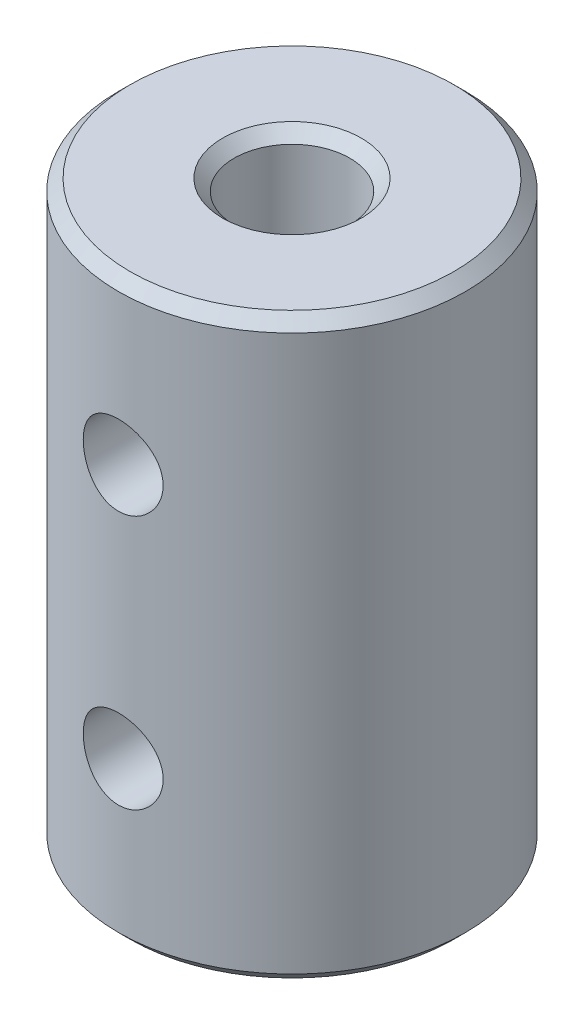
ISO-10303-21;
HEADER;
FILE_DESCRIPTION(('STEP AP214'),'2;1');
FILE_NAME('part.step','',(''),(''),'','','');
FILE_SCHEMA(('AUTOMOTIVE_DESIGN { 1 0 10303 214 1 1 1 1 }'));
ENDSEC;
DATA;
#1=APPLICATION_CONTEXT('core data for automotive mechanical design processes');
#2=APPLICATION_PROTOCOL_DEFINITION('international standard','automotive_design',2000,#1);
#3=PRODUCT_CONTEXT('',#1,'mechanical');
#4=PRODUCT('Part','Part','',(#3));
#5=PRODUCT_RELATED_PRODUCT_CATEGORY('part','',(#4));
#6=PRODUCT_DEFINITION_FORMATION('','',#4);
#7=PRODUCT_DEFINITION_CONTEXT('part definition',#1,'design');
#8=PRODUCT_DEFINITION('design','',#6,#7);
#9=PRODUCT_DEFINITION_SHAPE('','',#8);
#10=(LENGTH_UNIT() NAMED_UNIT(*) SI_UNIT(.MILLI.,.METRE.));
#11=(NAMED_UNIT(*) PLANE_ANGLE_UNIT() SI_UNIT($,.RADIAN.));
#12=(NAMED_UNIT(*) SI_UNIT($,.STERADIAN.) SOLID_ANGLE_UNIT());
#13=UNCERTAINTY_MEASURE_WITH_UNIT(LENGTH_MEASURE(1.E-05),#10,'distance_accuracy_value','');
#14=(GEOMETRIC_REPRESENTATION_CONTEXT(3) GLOBAL_UNCERTAINTY_ASSIGNED_CONTEXT((#13)) GLOBAL_UNIT_ASSIGNED_CONTEXT((#10,
#11,#12)) REPRESENTATION_CONTEXT('',''));
#15=CARTESIAN_POINT('',(0.,0.,0.));
#16=DIRECTION('',(0.,0.,1.));
#17=DIRECTION('',(1.,0.,0.));
#18=AXIS2_PLACEMENT_3D('',#15,#16,#17);
#19=CARTESIAN_POINT('',(0.,25.,0.));
#20=DIRECTION('',(0.,1.,0.));
#21=DIRECTION('',(0.,0.,1.));
#22=AXIS2_PLACEMENT_3D('',#19,#20,#21);
#23=PLANE('',#22);
#24=CARTESIAN_POINT('',(0.,25.,0.));
#25=DIRECTION('',(0.,1.,0.));
#26=DIRECTION('',(0.,0.,1.));
#27=AXIS2_PLACEMENT_3D('',#24,#25,#26);
#28=CIRCLE('',#27,3.);
#29=CARTESIAN_POINT('',(0.,25.,3.));
#30=VERTEX_POINT('',#29);
#31=EDGE_CURVE('E12',#30,#30,#28,.F.);
#32=ORIENTED_EDGE('',*,*,#31,.T.);
#33=EDGE_LOOP('',(#32));
#34=FACE_BOUND('',#33,.T.);
#35=CARTESIAN_POINT('',(0.,25.,0.));
#36=DIRECTION('',(0.,1.,0.));
#37=DIRECTION('',(0.,0.,1.));
#38=AXIS2_PLACEMENT_3D('',#35,#36,#37);
#39=CIRCLE('',#38,6.99999999999999);
#40=CARTESIAN_POINT('',(0.,25.,6.99999999999999));
#41=VERTEX_POINT('',#40);
#42=EDGE_CURVE('E71',#41,#41,#39,.T.);
#43=ORIENTED_EDGE('',*,*,#42,.T.);
#44=EDGE_LOOP('',(#43));
#45=FACE_BOUND('',#44,.T.);
#46=ADVANCED_FACE('F56',(#34,#45),#23,.T.);
#47=CARTESIAN_POINT('',(0.,0.,0.));
#48=DIRECTION('',(0.,1.,0.));
#49=DIRECTION('',(0.,0.,1.));
#50=AXIS2_PLACEMENT_3D('',#47,#48,#49);
#51=PLANE('',#50);
#52=CARTESIAN_POINT('',(0.,0.,0.));
#53=DIRECTION('',(0.,1.,0.));
#54=DIRECTION('',(0.,0.,1.));
#55=AXIS2_PLACEMENT_3D('',#52,#53,#54);
#56=CIRCLE('',#55,3.00000000000001);
#57=CARTESIAN_POINT('',(0.,0.,3.00000000000001));
#58=VERTEX_POINT('',#57);
#59=EDGE_CURVE('E159',#58,#58,#56,.T.);
#60=ORIENTED_EDGE('',*,*,#59,.T.);
#61=EDGE_LOOP('',(#60));
#62=FACE_BOUND('',#61,.T.);
#63=CARTESIAN_POINT('',(0.,0.,0.));
#64=DIRECTION('',(0.,1.,0.));
#65=DIRECTION('',(0.,0.,1.));
#66=AXIS2_PLACEMENT_3D('',#63,#64,#65);
#67=CIRCLE('',#66,6.99999999999999);
#68=CARTESIAN_POINT('',(0.,0.,6.99999999999999));
#69=VERTEX_POINT('',#68);
#70=EDGE_CURVE('E109',#69,#69,#67,.F.);
#71=ORIENTED_EDGE('',*,*,#70,.T.);
#72=EDGE_LOOP('',(#71));
#73=FACE_BOUND('',#72,.T.);
#74=ADVANCED_FACE('F119',(#62,#73),#51,.F.);
#75=CARTESIAN_POINT('',(0.,25.,0.));
#76=DIRECTION('',(0.,-1.,0.));
#77=DIRECTION('',(0.,0.,-1.));
#78=AXIS2_PLACEMENT_3D('',#75,#76,#77);
#79=CYLINDRICAL_SURFACE('',#78,7.5);
#80=CARTESIAN_POINT('',(1.7272,18.,7.29840942671758));
#81=CARTESIAN_POINT('',(1.72719689671245,17.9043729953796,7.29841134647614));
#82=CARTESIAN_POINT('',(1.71923133997462,17.8087097940839,7.30030933888067));
#83=CARTESIAN_POINT('',(1.68762004251188,17.6201133229452,7.3076803806128));
#84=CARTESIAN_POINT('',(1.66396375706963,17.5271819328648,7.31315583408208));
#85=CARTESIAN_POINT('',(1.60176318725499,17.34680434657,7.32702953165112));
#86=CARTESIAN_POINT('',(1.56323625594468,17.2593518945419,7.3354243678974));
#87=CARTESIAN_POINT('',(1.47243892079818,17.0921470950464,7.35418679859031));
#88=CARTESIAN_POINT('',(1.4201684872622,17.0123947642195,7.36455439730007));
#89=CARTESIAN_POINT('',(1.30232498331065,16.8613617895672,7.38631100039784));
#90=CARTESIAN_POINT('',(1.23654290199238,16.7902462493096,7.39771425453314));
#91=CARTESIAN_POINT('',(1.09399428257531,16.6599545837932,7.42013297213041));
#92=CARTESIAN_POINT('',(1.01722683268334,16.6007794505801,7.43114840330814));
#93=CARTESIAN_POINT('',(0.853770992240536,16.4953872673884,7.45170642392727));
#94=CARTESIAN_POINT('',(0.766976861474525,16.4493302345622,7.46123023616209));
#95=CARTESIAN_POINT('',(0.586624003699917,16.3725187214193,7.47757040856373));
#96=CARTESIAN_POINT('',(0.493066121563366,16.3417623336417,7.48438710619264));
#97=CARTESIAN_POINT('',(0.303559973451553,16.2969478668536,7.49444428085234));
#98=CARTESIAN_POINT('',(0.207681101790785,16.2826100018029,7.49774460991315));
#99=CARTESIAN_POINT('',(0.0148259042398842,16.2701635778878,7.50060498707878));
#100=CARTESIAN_POINT('',(-0.0821502815098565,16.2720529694548,7.50016550753674));
#101=CARTESIAN_POINT('',(-0.27251440784544,16.2918015822219,7.4956411058507));
#102=CARTESIAN_POINT('',(-0.365935528962463,16.3093590843845,7.49162506020196));
#103=CARTESIAN_POINT('',(-0.548468486537816,16.3594632474946,7.48047784146183));
#104=CARTESIAN_POINT('',(-0.637580114635642,16.3920106323918,7.47334651791618));
#105=CARTESIAN_POINT('',(-0.8097868902376,16.4714293576398,7.45666116274176));
#106=CARTESIAN_POINT('',(-0.892828549862957,16.5184125623843,7.44708831360306));
#107=CARTESIAN_POINT('',(-1.04995753160044,16.6252853523069,7.42656565058289));
#108=CARTESIAN_POINT('',(-1.12404350896614,16.6851768719936,7.41561563041381));
#109=CARTESIAN_POINT('',(-1.26295463538009,16.8178001124539,7.39324127355116));
#110=CARTESIAN_POINT('',(-1.32752717014485,16.8907958124389,7.38181182113311));
#111=CARTESIAN_POINT('',(-1.44356499441821,17.0466990177492,7.36000110061708));
#112=CARTESIAN_POINT('',(-1.49502984601367,17.129606854092,7.34961986754593));
#113=CARTESIAN_POINT('',(-1.58352085597055,17.3034199357961,7.33106559577494));
#114=CARTESIAN_POINT('',(-1.62049467638203,17.3943527432184,7.32290059358562));
#115=CARTESIAN_POINT('',(-1.67855747920049,17.5813747168079,7.30981121582831));
#116=CARTESIAN_POINT('',(-1.69964928721102,17.6774629624994,7.30488626383561));
#117=CARTESIAN_POINT('',(-1.72494791577378,17.8697476808301,7.29895343710465));
#118=CARTESIAN_POINT('',(-1.72952457600022,17.9658929052232,7.29785978104561));
#119=CARTESIAN_POINT('',(-1.7226682946177,18.1575726537795,7.29948122412418));
#120=CARTESIAN_POINT('',(-1.71123658294896,18.2531072242933,7.30219603065359));
#121=CARTESIAN_POINT('',(-1.67301020426905,18.4395359869485,7.31104707112064));
#122=CARTESIAN_POINT('',(-1.6464233261477,18.5304751890556,7.31713699886768));
#123=CARTESIAN_POINT('',(-1.57886819958474,18.7066076434749,7.33200954909902));
#124=CARTESIAN_POINT('',(-1.5378984541641,18.7918002965815,7.34079245185803));
#125=CARTESIAN_POINT('',(-1.44194033690514,18.9556099834368,7.36024700637274));
#126=CARTESIAN_POINT('',(-1.38672651703692,19.0340913817216,7.37094809906197));
#127=CARTESIAN_POINT('',(-1.26413899079961,19.1808107425306,7.39295761926233));
#128=CARTESIAN_POINT('',(-1.19676360186713,19.2490472852745,7.40426613065811));
#129=CARTESIAN_POINT('',(-1.05008333340781,19.3747976231184,7.42650191246428));
#130=CARTESIAN_POINT('',(-0.970558845438631,19.4320579347302,7.43741630220506));
#131=CARTESIAN_POINT('',(-0.802805891305377,19.5324077626008,7.45738740626459));
#132=CARTESIAN_POINT('',(-0.714577853170889,19.5754979752758,7.46644421186961));
#133=CARTESIAN_POINT('',(-0.532499063825965,19.6459425393006,7.4816258862619));
#134=CARTESIAN_POINT('',(-0.438690780678517,19.6734022437443,7.48777033678839));
#135=CARTESIAN_POINT('',(-0.247633680654803,19.7121314061987,7.4965200614134));
#136=CARTESIAN_POINT('',(-0.150385424066098,19.7234034884493,7.49912590916519));
#137=CARTESIAN_POINT('',(0.0423939636632866,19.7293088013018,7.50048550927552));
#138=CARTESIAN_POINT('',(0.137913126955127,19.7243188643394,7.49932650489885));
#139=CARTESIAN_POINT('',(0.326712472008982,19.6986918591036,7.49347587000969));
#140=CARTESIAN_POINT('',(0.419992702777971,19.6780551336385,7.48878431689244));
#141=CARTESIAN_POINT('',(0.601337947366754,19.6219089853326,7.47640474868465));
#142=CARTESIAN_POINT('',(0.689422005565017,19.5864582949655,7.46872857489537));
#143=CARTESIAN_POINT('',(0.858439171500176,19.5017458979427,7.451195211126));
#144=CARTESIAN_POINT('',(0.939371505369594,19.4524826990761,7.44133778552235));
#145=CARTESIAN_POINT('',(1.09360833422484,19.3403431423654,7.42025687479298));
#146=CARTESIAN_POINT('',(1.16671920851563,19.2772049997061,7.40900924494751));
#147=CARTESIAN_POINT('',(1.30143658841965,19.1396289463342,7.38653761779372));
#148=CARTESIAN_POINT('',(1.36304027310936,19.0651882729556,7.37531362694536));
#149=CARTESIAN_POINT('',(1.47390243330295,18.9057601266172,7.3539686729821));
#150=CARTESIAN_POINT('',(1.52295927555307,18.8206296849271,7.34386704400738));
#151=CARTESIAN_POINT('',(1.60599136473468,18.6431145794032,7.32615912730855));
#152=CARTESIAN_POINT('',(1.63997875312475,18.5507358264288,7.31855083199982));
#153=CARTESIAN_POINT('',(1.68619216357411,18.3819563985902,7.30802171990387));
#154=CARTESIAN_POINT('',(1.70153923186245,18.3064359673301,7.30444213317457));
#155=CARTESIAN_POINT('',(1.72204409314212,18.153951453046,7.2996352844755));
#156=CARTESIAN_POINT('',(1.72720249839695,18.0769874570502,7.29840788115699));
#157=CARTESIAN_POINT('',(1.7272,18.,7.29840942671758));
#158=B_SPLINE_CURVE_WITH_KNOTS('',3,(#80,#81,#82,#83,#84,#85,#86,#87,#88,#89,#90,#91,#92,#93,
#94,#95,#96,#97,#98,#99,#100,#101,#102,#103,#104,#105,#106,#107,#108,#109,#110,#111,#112,#113,
#114,#115,#116,#117,#118,#119,#120,#121,#122,#123,#124,#125,#126,#127,#128,#129,#130,#131,#132,
#133,#134,#135,#136,#137,#138,#139,#140,#141,#142,#143,#144,#145,#146,#147,#148,#149,#150,#151,
#152,#153,#154,#155,#156,#157),.UNSPECIFIED.,.T.,.F.,(4,2,2,2,2,2,2,2,2,2,2,2,2,2,2,2,2,2,2,2,2,
2,2,2,2,2,2,2,2,2,2,2,2,2,2,2,2,2,4),(0.,0.286598668390399,0.573390136500472,0.859847944788198,
1.14630637211748,1.43758423379657,1.72888628577708,2.02360280831184,2.31828258068474,
2.60786231251336,2.89740546977814,3.18149044240456,3.46558913660573,3.75194736248027,
4.03834853339415,4.33134650901888,4.62435427209719,4.91841076222403,5.21241492374903,
5.49979282590026,5.78714864971366,6.0706562416737,6.35419335005768,6.64252750121625,
6.93090157426736,7.22529356474638,7.51967108461034,7.81204019676436,8.10436190644285,
8.38995837115482,8.67554857886439,8.96001710010956,9.24451636527699,9.53493184577661,
9.82541842684983,10.120315360374,10.4149742617639,10.6457231887518,10.8764582490094),.UNSPECIFIED.);
#159=CARTESIAN_POINT('',(1.7272,18.,7.29840942671758));
#160=VERTEX_POINT('',#159);
#161=EDGE_CURVE('E89',#160,#160,#158,.T.);
#162=ORIENTED_EDGE('',*,*,#161,.T.);
#163=EDGE_LOOP('',(#162));
#164=FACE_BOUND('',#163,.T.);
#165=CARTESIAN_POINT('',(1.7272,7.,7.29840942671758));
#166=CARTESIAN_POINT('',(1.72719689671245,6.9043729953796,7.29841134647614));
#167=CARTESIAN_POINT('',(1.71923133997462,6.80870979408393,7.30030933888067));
#168=CARTESIAN_POINT('',(1.68762004251188,6.62011332294517,7.3076803806128));
#169=CARTESIAN_POINT('',(1.66396375706963,6.52718193286483,7.31315583408208));
#170=CARTESIAN_POINT('',(1.60176318725498,6.34680434657005,7.32702953165112));
#171=CARTESIAN_POINT('',(1.56323625594468,6.25935189454189,7.3354243678974));
#172=CARTESIAN_POINT('',(1.47243892079817,6.09214709504637,7.35418679859031));
#173=CARTESIAN_POINT('',(1.4201684872622,6.01239476421952,7.36455439730007));
#174=CARTESIAN_POINT('',(1.30232498331065,5.86136178956722,7.38631100039784));
#175=CARTESIAN_POINT('',(1.23654290199238,5.79024624930955,7.39771425453314));
#176=CARTESIAN_POINT('',(1.09399428257531,5.65995458379321,7.42013297213041));
#177=CARTESIAN_POINT('',(1.01722683268334,5.60077945058013,7.43114840330814));
#178=CARTESIAN_POINT('',(0.853770992240534,5.49538726738837,7.45170642392727));
#179=CARTESIAN_POINT('',(0.766976861474523,5.44933023456223,7.46123023616209));
#180=CARTESIAN_POINT('',(0.586624003699915,5.37251872141932,7.47757040856373));
#181=CARTESIAN_POINT('',(0.493066121563364,5.34176233364173,7.48438710619264));
#182=CARTESIAN_POINT('',(0.303559973451551,5.29694786685357,7.49444428085234));
#183=CARTESIAN_POINT('',(0.207681101790783,5.28261000180287,7.49774460991315));
#184=CARTESIAN_POINT('',(0.0148259042398826,5.27016357788784,7.50060498707878));
#185=CARTESIAN_POINT('',(-0.0821502815098581,5.27205296945479,7.50016550753674));
#186=CARTESIAN_POINT('',(-0.272514407845442,5.29180158222189,7.4956411058507));
#187=CARTESIAN_POINT('',(-0.365935528962465,5.30935908438446,7.49162506020197));
#188=CARTESIAN_POINT('',(-0.548468486537818,5.35946324749458,7.48047784146183));
#189=CARTESIAN_POINT('',(-0.637580114635644,5.3920106323918,7.47334651791618));
#190=CARTESIAN_POINT('',(-0.809786890237602,5.47142935763976,7.45666116274176));
#191=CARTESIAN_POINT('',(-0.892828549862958,5.51841256238426,7.44708831360306));
#192=CARTESIAN_POINT('',(-1.04995753160044,5.62528535230695,7.42656565058289));
#193=CARTESIAN_POINT('',(-1.12404350896614,5.68517687199363,7.41561563041381));
#194=CARTESIAN_POINT('',(-1.26295463538009,5.81780011245392,7.39324127355116));
#195=CARTESIAN_POINT('',(-1.32752717014485,5.89079581243892,7.38181182113311));
#196=CARTESIAN_POINT('',(-1.44356499441822,6.04669901774921,7.36000110061707));
#197=CARTESIAN_POINT('',(-1.49502984601367,6.12960685409205,7.34961986754593));
#198=CARTESIAN_POINT('',(-1.58352085597055,6.30341993579612,7.33106559577494));
#199=CARTESIAN_POINT('',(-1.62049467638203,6.39435274321843,7.32290059358562));
#200=CARTESIAN_POINT('',(-1.6785574792005,6.58137471680788,7.30981121582831));
#201=CARTESIAN_POINT('',(-1.69964928721102,6.67746296249944,7.30488626383561));
#202=CARTESIAN_POINT('',(-1.72494791577378,6.86974768083015,7.29895343710465));
#203=CARTESIAN_POINT('',(-1.72952457600022,6.96589290522325,7.29785978104561));
#204=CARTESIAN_POINT('',(-1.7226682946177,7.1575726537795,7.29948122412418));
#205=CARTESIAN_POINT('',(-1.71123658294896,7.25310722429333,7.30219603065359));
#206=CARTESIAN_POINT('',(-1.67301020426905,7.43953598694853,7.31104707112064));
#207=CARTESIAN_POINT('',(-1.64642332614769,7.5304751890556,7.31713699886768));
#208=CARTESIAN_POINT('',(-1.57886819958474,7.70660764347488,7.33200954909902));
#209=CARTESIAN_POINT('',(-1.5378984541641,7.79180029658146,7.34079245185803));
#210=CARTESIAN_POINT('',(-1.44194033690514,7.95560998343677,7.36024700637274));
#211=CARTESIAN_POINT('',(-1.38672651703692,8.03409138172157,7.37094809906197));
#212=CARTESIAN_POINT('',(-1.26413899079961,8.18081074253059,7.39295761926233));
#213=CARTESIAN_POINT('',(-1.19676360186713,8.24904728527452,7.40426613065811));
#214=CARTESIAN_POINT('',(-1.05008333340781,8.37479762311838,7.42650191246428));
#215=CARTESIAN_POINT('',(-0.970558845438629,8.43205793473025,7.43741630220506));
#216=CARTESIAN_POINT('',(-0.802805891305374,8.53240776260079,7.45738740626459));
#217=CARTESIAN_POINT('',(-0.714577853170886,8.57549797527582,7.46644421186961));
#218=CARTESIAN_POINT('',(-0.532499063825962,8.6459425393006,7.4816258862619));
#219=CARTESIAN_POINT('',(-0.438690780678515,8.67340224374432,7.48777033678839));
#220=CARTESIAN_POINT('',(-0.247633680654801,8.71213140619867,7.4965200614134));
#221=CARTESIAN_POINT('',(-0.150385424066096,8.7234034884493,7.49912590916519));
#222=CARTESIAN_POINT('',(0.042393963663289,8.72930880130184,7.50048550927552));
#223=CARTESIAN_POINT('',(0.13791312695513,8.72431886433936,7.49932650489885));
#224=CARTESIAN_POINT('',(0.326712472008984,8.69869185910355,7.49347587000969));
#225=CARTESIAN_POINT('',(0.419992702777973,8.67805513363847,7.48878431689244));
#226=CARTESIAN_POINT('',(0.601337947366757,8.62190898533259,7.47640474868465));
#227=CARTESIAN_POINT('',(0.68942200556502,8.58645829496547,7.46872857489537));
#228=CARTESIAN_POINT('',(0.85843917150018,8.50174589794267,7.451195211126));
#229=CARTESIAN_POINT('',(0.939371505369597,8.45248269907612,7.44133778552235));
#230=CARTESIAN_POINT('',(1.09360833422484,8.34034314236537,7.42025687479298));
#231=CARTESIAN_POINT('',(1.16671920851563,8.27720499970614,7.40900924494751));
#232=CARTESIAN_POINT('',(1.30143658841965,8.13962894633421,7.38653761779372));
#233=CARTESIAN_POINT('',(1.36304027310936,8.06518827295562,7.37531362694536));
#234=CARTESIAN_POINT('',(1.47390243330295,7.90576012661717,7.3539686729821));
#235=CARTESIAN_POINT('',(1.52295927555308,7.82062968492707,7.34386704400738));
#236=CARTESIAN_POINT('',(1.60599136473468,7.64311457940319,7.32615912730855));
#237=CARTESIAN_POINT('',(1.63997875312475,7.55073582642881,7.31855083199982));
#238=CARTESIAN_POINT('',(1.68619216357411,7.38195639859021,7.30802171990387));
#239=CARTESIAN_POINT('',(1.70153923186245,7.30643596733007,7.30444213317457));
#240=CARTESIAN_POINT('',(1.72204409314212,7.15395145304596,7.2996352844755));
#241=CARTESIAN_POINT('',(1.72720249839695,7.07698745705018,7.29840788115699));
#242=CARTESIAN_POINT('',(1.7272,7.,7.29840942671758));
#243=B_SPLINE_CURVE_WITH_KNOTS('',3,(#165,#166,#167,#168,#169,#170,#171,#172,#173,#174,#175,
#176,#177,#178,#179,#180,#181,#182,#183,#184,#185,#186,#187,#188,#189,#190,#191,#192,#193,#194,
#195,#196,#197,#198,#199,#200,#201,#202,#203,#204,#205,#206,#207,#208,#209,#210,#211,#212,#213,
#214,#215,#216,#217,#218,#219,#220,#221,#222,#223,#224,#225,#226,#227,#228,#229,#230,#231,#232,
#233,#234,#235,#236,#237,#238,#239,#240,#241,#242),.UNSPECIFIED.,.T.,.F.,(4,2,2,2,2,2,2,2,2,2,2,
2,2,2,2,2,2,2,2,2,2,2,2,2,2,2,2,2,2,2,2,2,2,2,2,2,2,2,4),(0.,0.2865986683904,0.573390136500474,
0.859847944788205,1.14630637211749,1.43758423379658,1.72888628577709,2.02360280831184,
2.31828258068474,2.60786231251336,2.89740546977814,3.18149044240456,3.46558913660573,
3.75194736248027,4.03834853339415,4.33134650901888,4.62435427209719,4.91841076222403,
5.21241492374904,5.49979282590026,5.78714864971366,6.07065624167371,6.35419335005768,
6.64252750121625,6.93090157426736,7.22529356474638,7.51967108461034,7.81204019676436,
8.10436190644285,8.38995837115482,8.67554857886439,8.96001710010957,9.24451636527699,
9.53493184577662,9.82541842684983,10.120315360374,10.4149742617639,10.6457231887518,
10.8764582490094),.UNSPECIFIED.);
#244=CARTESIAN_POINT('',(1.7272,7.,7.29840942671758));
#245=VERTEX_POINT('',#244);
#246=EDGE_CURVE('E88',#245,#245,#243,.T.);
#247=ORIENTED_EDGE('',*,*,#246,.T.);
#248=EDGE_LOOP('',(#247));
#249=FACE_BOUND('',#248,.T.);
#250=CARTESIAN_POINT('',(0.,0.500000000000007,0.));
#251=DIRECTION('',(0.,1.,0.));
#252=DIRECTION('',(0.,0.,1.));
#253=AXIS2_PLACEMENT_3D('',#250,#251,#252);
#254=CIRCLE('',#253,7.5);
#255=CARTESIAN_POINT('',(0.,0.500000000000007,7.5));
#256=VERTEX_POINT('',#255);
#257=EDGE_CURVE('E78',#256,#256,#254,.T.);
#258=ORIENTED_EDGE('',*,*,#257,.T.);
#259=EDGE_LOOP('',(#258));
#260=FACE_BOUND('',#259,.T.);
#261=CARTESIAN_POINT('',(0.,24.5,0.));
#262=DIRECTION('',(0.,1.,0.));
#263=DIRECTION('',(0.,0.,1.));
#264=AXIS2_PLACEMENT_3D('',#261,#262,#263);
#265=CIRCLE('',#264,7.5);
#266=CARTESIAN_POINT('',(0.,24.5,7.5));
#267=VERTEX_POINT('',#266);
#268=EDGE_CURVE('E175',#267,#267,#265,.F.);
#269=ORIENTED_EDGE('',*,*,#268,.T.);
#270=EDGE_LOOP('',(#269));
#271=FACE_BOUND('',#270,.T.);
#272=ADVANCED_FACE('F114',(#164,#249,#260,#271),#79,.T.);
#273=CARTESIAN_POINT('',(0.,25.,0.));
#274=DIRECTION('',(0.,-1.,0.));
#275=DIRECTION('',(0.,0.,-1.));
#276=AXIS2_PLACEMENT_3D('',#273,#274,#275);
#277=CYLINDRICAL_SURFACE('',#276,2.5);
#278=CARTESIAN_POINT('',(1.7272,18.,1.80742362494242));
#279=CARTESIAN_POINT('',(1.72719458036539,17.916710277829,1.80743381655066));
#280=CARTESIAN_POINT('',(1.72111865256169,17.8333856351055,1.81329487787684));
#281=CARTESIAN_POINT('',(1.69736810895408,17.6697967241395,1.8355334492351));
#282=CARTESIAN_POINT('',(1.67966853876421,17.5895394342516,1.85193358359981));
#283=CARTESIAN_POINT('',(1.63415378546239,17.4350317020876,1.89220609667077));
#284=CARTESIAN_POINT('',(1.60644798596074,17.3607265354419,1.9159973006032));
#285=CARTESIAN_POINT('',(1.54201035940373,17.2179749705864,1.96822849707107));
#286=CARTESIAN_POINT('',(1.50527749359209,17.1495292478533,1.99666902448403));
#287=CARTESIAN_POINT('',(1.41659794519417,17.0077296871095,2.0607581928178));
#288=CARTESIAN_POINT('',(1.36312770821708,16.935511426576,2.09681136709467));
#289=CARTESIAN_POINT('',(1.24556102921294,16.8000631626871,2.16871827124362));
#290=CARTESIAN_POINT('',(1.18145205927744,16.7368439213706,2.20457171385044));
#291=CARTESIAN_POINT('',(1.03206845816619,16.611097372992,2.27878405428116));
#292=CARTESIAN_POINT('',(0.945048299189779,16.5503062320023,2.31662295660661));
#293=CARTESIAN_POINT('',(0.75892692288172,16.4448064118709,2.38406514713715));
#294=CARTESIAN_POINT('',(0.659849615477116,16.400066576336,2.41368436456191));
#295=CARTESIAN_POINT('',(0.479866020909511,16.3388368801868,2.45476691667471));
#296=CARTESIAN_POINT('',(0.401046504843353,16.3180101332008,2.46895747339288));
#297=CARTESIAN_POINT('',(0.240298888540523,16.2876481823561,2.48973954463689));
#298=CARTESIAN_POINT('',(0.158373283589093,16.2781041049134,2.49633703084585));
#299=CARTESIAN_POINT('',(-0.00640540080673293,16.2708402378819,2.50135301453879));
#300=CARTESIAN_POINT('',(-0.0892599027584161,16.2731421109483,2.49975652774229));
#301=CARTESIAN_POINT('',(-0.253248694873963,16.289479931551,2.48849846408101));
#302=CARTESIAN_POINT('',(-0.334382486789181,16.303519231465,2.47883458305366));
#303=CARTESIAN_POINT('',(-0.491034394180252,16.3421449280642,2.45256373952973));
#304=CARTESIAN_POINT('',(-0.566634331197404,16.3665052877886,2.43610575906864));
#305=CARTESIAN_POINT('',(-0.712527091109163,16.4246591884864,2.39750014735919));
#306=CARTESIAN_POINT('',(-0.782818886296957,16.4584545502472,2.37535141796334));
#307=CARTESIAN_POINT('',(-0.924684411412348,16.5386488752298,2.32406311104724));
#308=CARTESIAN_POINT('',(-0.995512241232761,16.586038188613,2.29441731570909));
#309=CARTESIAN_POINT('',(-1.12867002969542,16.6898602964072,2.2319332786907));
#310=CARTESIAN_POINT('',(-1.1909903837147,16.7463031581729,2.19909149932242));
#311=CARTESIAN_POINT('',(-1.31669824618304,16.8778615758116,2.12660271790553));
#312=CARTESIAN_POINT('',(-1.37837228680776,16.9545167170584,2.08676869893903));
#313=CARTESIAN_POINT('',(-1.48836745909516,17.1181320969131,2.00979122793787));
#314=CARTESIAN_POINT('',(-1.53669373747632,17.2050883450197,1.97264674294268));
#315=CARTESIAN_POINT('',(-1.60886388284569,17.367009103217,1.91394733713363));
#316=CARTESIAN_POINT('',(-1.63579135070789,17.440004728898,1.89077919724987));
#317=CARTESIAN_POINT('',(-1.67983681192194,17.5907227000222,1.85176136719743));
#318=CARTESIAN_POINT('',(-1.69697306799342,17.6684359444614,1.83589806273823));
#319=CARTESIAN_POINT('',(-1.72047640647505,17.8276605858419,1.81390185418945));
#320=CARTESIAN_POINT('',(-1.72674225692698,17.9092004984647,1.80786045003029));
#321=CARTESIAN_POINT('',(-1.72760872769735,18.0723974187244,1.80703363890805));
#322=CARTESIAN_POINT('',(-1.72221149346553,18.1540544020646,1.81224616176052));
#323=CARTESIAN_POINT('',(-1.70167362613928,18.3041927212228,1.83151838322318));
#324=CARTESIAN_POINT('',(-1.68786177745798,18.3730273659717,1.84436646357582));
#325=CARTESIAN_POINT('',(-1.65250160496096,18.507229327003,1.87611367845224));
#326=CARTESIAN_POINT('',(-1.63094561468605,18.5725931334019,1.89501880725201));
#327=CARTESIAN_POINT('',(-1.5692114958262,18.7285125445852,1.9467534441007));
#328=CARTESIAN_POINT('',(-1.52503337497385,18.8166907156162,1.98197429156377));
#329=CARTESIAN_POINT('',(-1.42335129063036,18.9832835378897,2.05622182839791));
#330=CARTESIAN_POINT('',(-1.36582180263281,19.0616790399797,2.09525572353341));
#331=CARTESIAN_POINT('',(-1.23733187489735,19.2091077488144,2.17365428323059));
#332=CARTESIAN_POINT('',(-1.166163748575,19.2779633302523,2.21301363321236));
#333=CARTESIAN_POINT('',(-1.01187396226487,19.4032735417655,2.2876698471516));
#334=CARTESIAN_POINT('',(-0.928770766625803,19.4597469929709,2.32297283744099));
#335=CARTESIAN_POINT('',(-0.766722732235033,19.5499826620545,2.38080753645644));
#336=CARTESIAN_POINT('',(-0.68943032901831,19.5859673268589,2.40448863862741));
#337=CARTESIAN_POINT('',(-0.528751897200967,19.6465102741424,2.4448445201054));
#338=CARTESIAN_POINT('',(-0.445369712605344,19.6710756937926,2.46152367508345));
#339=CARTESIAN_POINT('',(-0.2741430128895,19.7075602653852,2.48643565834327));
#340=CARTESIAN_POINT('',(-0.186277157860423,19.7194115874808,2.49462317601993));
#341=CARTESIAN_POINT('',(-0.00940066915678429,19.7294417804002,2.50154637619258));
#342=CARTESIAN_POINT('',(0.0796096012720755,19.7276248876382,2.50028498734373));
#343=CARTESIAN_POINT('',(0.24772493934125,19.711240051649,2.48899468365999));
#344=CARTESIAN_POINT('',(0.327002094557125,19.6978309803958,2.47976269793627));
#345=CARTESIAN_POINT('',(0.481876039865193,19.6605310496839,2.45437513609934));
#346=CARTESIAN_POINT('',(0.557472091460275,19.6366380965122,2.43821817702987));
#347=CARTESIAN_POINT('',(0.706499375859762,19.5782128761239,2.39938314762264));
#348=CARTESIAN_POINT('',(0.77970585482786,19.5432754185748,2.37645940057679));
#349=CARTESIAN_POINT('',(0.919327029203756,19.4644091763054,2.32601731538185));
#350=CARTESIAN_POINT('',(0.985740275104988,19.4204784786289,2.29849799993711));
#351=CARTESIAN_POINT('',(1.12101850338495,19.3171485754186,2.23600128674885));
#352=CARTESIAN_POINT('',(1.18862705192537,19.2564032701535,2.20053157374508));
#353=CARTESIAN_POINT('',(1.31339529544625,19.1253531382959,2.12842721880854));
#354=CARTESIAN_POINT('',(1.37053167687273,19.0550275757576,2.09179018581342));
#355=CARTESIAN_POINT('',(1.48111392118716,18.8946335709524,2.01530074562388));
#356=CARTESIAN_POINT('',(1.53279440310848,18.8031820763471,1.97576302697271));
#357=CARTESIAN_POINT('',(1.61944650343939,18.6097076061731,1.9053936430562));
#358=CARTESIAN_POINT('',(1.65447983240592,18.5077254073385,1.8745299999234));
#359=CARTESIAN_POINT('',(1.69533988447618,18.3368873445635,1.83746141675767));
#360=CARTESIAN_POINT('',(1.7072251001894,18.2705401161916,1.82633510120555));
#361=CARTESIAN_POINT('',(1.72315311011038,18.1361350745453,1.81131597180675));
#362=CARTESIAN_POINT('',(1.72720442989114,18.0680792026074,1.8074152945441));
#363=CARTESIAN_POINT('',(1.7272,18.,1.80742362494242));
#364=B_SPLINE_CURVE_WITH_KNOTS('',3,(#278,#279,#280,#281,#282,#283,#284,#285,#286,#287,#288,
#289,#290,#291,#292,#293,#294,#295,#296,#297,#298,#299,#300,#301,#302,#303,#304,#305,#306,#307,
#308,#309,#310,#311,#312,#313,#314,#315,#316,#317,#318,#319,#320,#321,#322,#323,#324,#325,#326,
#327,#328,#329,#330,#331,#332,#333,#334,#335,#336,#337,#338,#339,#340,#341,#342,#343,#344,#345,
#346,#347,#348,#349,#350,#351,#352,#353,#354,#355,#356,#357,#358,#359,#360,#361,#362,#363),
.UNSPECIFIED.,.T.,.F.,(4,2,2,2,2,2,2,2,2,2,2,2,2,2,2,2,2,2,2,2,2,2,2,2,2,2,2,2,2,2,2,2,2,2,2,2,
2,2,2,2,2,2,4),(0.,0.249546561261099,0.499630624306906,0.747059758430713,0.99451737789017,
1.28393313181656,1.57369214496348,1.90991005674059,2.24547177596852,2.49265563421759,
2.73964495791866,2.98708611060057,3.23459796018501,3.47694859200192,3.7193460255469,
3.98902129524957,4.25899854395884,4.57611312919466,4.89310526804538,5.13577154655672,
5.37798371007396,5.622439632495,5.86685059054684,6.08012635825113,6.29361384678156,
6.60612257118459,6.91923372926594,7.23755845205919,7.55539590670517,7.81976270229527,
8.08396404243052,8.34956799520916,8.6150896283891,8.85678414650759,9.09852695489212,
9.35043658224919,9.60239984920206,9.89398067284809,10.1862029431236,10.5212135264765,
10.8549723546481,11.0591686226614,11.2631425399856),.UNSPECIFIED.);
#365=CARTESIAN_POINT('',(1.7272,18.,1.80742362494242));
#366=VERTEX_POINT('',#365);
#367=EDGE_CURVE('E61',#366,#366,#364,.T.);
#368=ORIENTED_EDGE('',*,*,#367,.F.);
#369=EDGE_LOOP('',(#368));
#370=FACE_BOUND('',#369,.T.);
#371=CARTESIAN_POINT('',(1.7272,7.,1.80742362494242));
#372=CARTESIAN_POINT('',(1.72719458036539,6.91671027782898,1.80743381655066));
#373=CARTESIAN_POINT('',(1.72111865256169,6.83338563510546,1.81329487787684));
#374=CARTESIAN_POINT('',(1.69736810895408,6.66979672413945,1.8355334492351));
#375=CARTESIAN_POINT('',(1.67966853876421,6.58953943425158,1.85193358359981));
#376=CARTESIAN_POINT('',(1.63415378546239,6.43503170208756,1.89220609667077));
#377=CARTESIAN_POINT('',(1.60644798596074,6.36072653544194,1.9159973006032));
#378=CARTESIAN_POINT('',(1.54201035940373,6.21797497058637,1.96822849707107));
#379=CARTESIAN_POINT('',(1.50527749359209,6.1495292478533,1.99666902448403));
#380=CARTESIAN_POINT('',(1.41659794519417,6.00772968710948,2.0607581928178));
#381=CARTESIAN_POINT('',(1.36312770821707,5.935511426576,2.09681136709467));
#382=CARTESIAN_POINT('',(1.24556102921293,5.80006316268705,2.16871827124362));
#383=CARTESIAN_POINT('',(1.18145205927744,5.73684392137061,2.20457171385044));
#384=CARTESIAN_POINT('',(1.03206845816619,5.61109737299197,2.27878405428116));
#385=CARTESIAN_POINT('',(0.945048299189778,5.55030623200227,2.31662295660662));
#386=CARTESIAN_POINT('',(0.758926922881719,5.44480641187087,2.38406514713715));
#387=CARTESIAN_POINT('',(0.659849615477114,5.40006657633603,2.41368436456191));
#388=CARTESIAN_POINT('',(0.479866020909508,5.33883688018676,2.45476691667471));
#389=CARTESIAN_POINT('',(0.401046504843351,5.31801013320084,2.46895747339288));
#390=CARTESIAN_POINT('',(0.24029888854052,5.28764818235608,2.48973954463689));
#391=CARTESIAN_POINT('',(0.158373283589091,5.27810410491345,2.49633703084585));
#392=CARTESIAN_POINT('',(-0.00640540080673505,5.27084023788187,2.50135301453879));
#393=CARTESIAN_POINT('',(-0.0892599027584185,5.2731421109483,2.49975652774229));
#394=CARTESIAN_POINT('',(-0.253248694873965,5.28947993155095,2.48849846408101));
#395=CARTESIAN_POINT('',(-0.334382486789183,5.30351923146497,2.47883458305366));
#396=CARTESIAN_POINT('',(-0.491034394180255,5.34214492806418,2.45256373952973));
#397=CARTESIAN_POINT('',(-0.566634331197406,5.36650528778863,2.43610575906864));
#398=CARTESIAN_POINT('',(-0.712527091109166,5.42465918848639,2.39750014735919));
#399=CARTESIAN_POINT('',(-0.782818886296959,5.45845455024723,2.37535141796334));
#400=CARTESIAN_POINT('',(-0.92468441141235,5.5386488752298,2.32406311104724));
#401=CARTESIAN_POINT('',(-0.995512241232761,5.58603818861299,2.29441731570909));
#402=CARTESIAN_POINT('',(-1.12867002969542,5.68986029640717,2.2319332786907));
#403=CARTESIAN_POINT('',(-1.1909903837147,5.74630315817294,2.19909149932242));
#404=CARTESIAN_POINT('',(-1.31669824618305,5.87786157581162,2.12660271790553));
#405=CARTESIAN_POINT('',(-1.37837228680777,5.95451671705843,2.08676869893903));
#406=CARTESIAN_POINT('',(-1.48836745909516,6.11813209691309,2.00979122793787));
#407=CARTESIAN_POINT('',(-1.53669373747632,6.20508834501966,1.97264674294268));
#408=CARTESIAN_POINT('',(-1.60886388284569,6.36700910321705,1.91394733713363));
#409=CARTESIAN_POINT('',(-1.63579135070789,6.44000472889804,1.89077919724987));
#410=CARTESIAN_POINT('',(-1.67983681192194,6.59072270002223,1.85176136719743));
#411=CARTESIAN_POINT('',(-1.69697306799342,6.66843594446136,1.83589806273824));
#412=CARTESIAN_POINT('',(-1.72047640647505,6.82766058584185,1.81390185418945));
#413=CARTESIAN_POINT('',(-1.72674225692698,6.90920049846469,1.80786045003029));
#414=CARTESIAN_POINT('',(-1.72760872769735,7.07239741872445,1.80703363890805));
#415=CARTESIAN_POINT('',(-1.72221149346553,7.1540544020646,1.81224616176052));
#416=CARTESIAN_POINT('',(-1.70167362613928,7.30419272122281,1.83151838322318));
#417=CARTESIAN_POINT('',(-1.68786177745798,7.37302736597169,1.84436646357582));
#418=CARTESIAN_POINT('',(-1.65250160496096,7.50722932700305,1.87611367845224));
#419=CARTESIAN_POINT('',(-1.63094561468605,7.57259313340191,1.89501880725201));
#420=CARTESIAN_POINT('',(-1.5692114958262,7.7285125445852,1.9467534441007));
#421=CARTESIAN_POINT('',(-1.52503337497385,7.81669071561616,1.98197429156377));
#422=CARTESIAN_POINT('',(-1.42335129063036,7.98328353788971,2.05622182839791));
#423=CARTESIAN_POINT('',(-1.36582180263281,8.0616790399797,2.09525572353341));
#424=CARTESIAN_POINT('',(-1.23733187489735,8.20910774881444,2.1736542832306));
#425=CARTESIAN_POINT('',(-1.16616374857499,8.27796333025232,2.21301363321236));
#426=CARTESIAN_POINT('',(-1.01187396226487,8.40327354176553,2.2876698471516));
#427=CARTESIAN_POINT('',(-0.928770766625799,8.45974699297085,2.32297283744099));
#428=CARTESIAN_POINT('',(-0.76672273223503,8.54998266205455,2.38080753645644));
#429=CARTESIAN_POINT('',(-0.689430329018306,8.58596732685887,2.40448863862741));
#430=CARTESIAN_POINT('',(-0.528751897200962,8.6465102741424,2.4448445201054));
#431=CARTESIAN_POINT('',(-0.445369712605339,8.67107569379262,2.46152367508345));
#432=CARTESIAN_POINT('',(-0.274143012889494,8.70756026538523,2.48643565834327));
#433=CARTESIAN_POINT('',(-0.186277157860417,8.71941158748076,2.49462317601993));
#434=CARTESIAN_POINT('',(-0.00940066915677914,8.72944178040017,2.50154637619258));
#435=CARTESIAN_POINT('',(0.0796096012720806,8.72762488763816,2.50028498734373));
#436=CARTESIAN_POINT('',(0.247724939341255,8.71124005164901,2.48899468365999));
#437=CARTESIAN_POINT('',(0.32700209455713,8.69783098039583,2.47976269793627));
#438=CARTESIAN_POINT('',(0.481876039865197,8.66053104968394,2.45437513609934));
#439=CARTESIAN_POINT('',(0.557472091460279,8.63663809651217,2.43821817702987));
#440=CARTESIAN_POINT('',(0.706499375859766,8.57821287612393,2.39938314762264));
#441=CARTESIAN_POINT('',(0.779705854827865,8.54327541857478,2.37645940057679));
#442=CARTESIAN_POINT('',(0.919327029203761,8.46440917630541,2.32601731538185));
#443=CARTESIAN_POINT('',(0.985740275104992,8.42047847862887,2.29849799993711));
#444=CARTESIAN_POINT('',(1.12101850338495,8.31714857541862,2.23600128674885));
#445=CARTESIAN_POINT('',(1.18862705192537,8.25640327015351,2.20053157374508));
#446=CARTESIAN_POINT('',(1.31339529544625,8.12535313829593,2.12842721880854));
#447=CARTESIAN_POINT('',(1.37053167687273,8.05502757575756,2.09179018581342));
#448=CARTESIAN_POINT('',(1.48111392118716,7.89463357095243,2.01530074562388));
#449=CARTESIAN_POINT('',(1.53279440310848,7.80318207634705,1.97576302697271));
#450=CARTESIAN_POINT('',(1.61944650343939,7.60970760617311,1.90539364305619));
#451=CARTESIAN_POINT('',(1.65447983240592,7.50772540733846,1.8745299999234));
#452=CARTESIAN_POINT('',(1.69533988447618,7.33688734456354,1.83746141675767));
#453=CARTESIAN_POINT('',(1.7072251001894,7.27054011619163,1.82633510120555));
#454=CARTESIAN_POINT('',(1.72315311011038,7.1361350745453,1.81131597180675));
#455=CARTESIAN_POINT('',(1.72720442989114,7.06807920260737,1.8074152945441));
#456=CARTESIAN_POINT('',(1.7272,7.,1.80742362494242));
#457=B_SPLINE_CURVE_WITH_KNOTS('',3,(#371,#372,#373,#374,#375,#376,#377,#378,#379,#380,#381,
#382,#383,#384,#385,#386,#387,#388,#389,#390,#391,#392,#393,#394,#395,#396,#397,#398,#399,#400,
#401,#402,#403,#404,#405,#406,#407,#408,#409,#410,#411,#412,#413,#414,#415,#416,#417,#418,#419,
#420,#421,#422,#423,#424,#425,#426,#427,#428,#429,#430,#431,#432,#433,#434,#435,#436,#437,#438,
#439,#440,#441,#442,#443,#444,#445,#446,#447,#448,#449,#450,#451,#452,#453,#454,#455,#456),
.UNSPECIFIED.,.T.,.F.,(4,2,2,2,2,2,2,2,2,2,2,2,2,2,2,2,2,2,2,2,2,2,2,2,2,2,2,2,2,2,2,2,2,2,2,2,
2,2,2,2,2,2,4),(0.,0.2495465612611,0.499630624306908,0.747059758430713,0.994517377890171,
1.28393313181656,1.57369214496348,1.90991005674059,2.24547177596852,2.49265563421759,
2.73964495791866,2.98708611060057,3.23459796018501,3.47694859200192,3.7193460255469,
3.98902129524956,4.25899854395884,4.57611312919466,4.89310526804538,5.13577154655672,
5.37798371007396,5.62243963249499,5.86685059054684,6.08012635825113,6.29361384678156,
6.60612257118459,6.91923372926594,7.2375584520592,7.55539590670517,7.81976270229527,
8.08396404243053,8.34956799520916,8.61508962838911,8.8567841465076,9.09852695489213,
9.3504365822492,9.60239984920207,9.89398067284809,10.1862029431236,10.5212135264765,
10.8549723546481,11.0591686226614,11.2631425399856),.UNSPECIFIED.);
#458=CARTESIAN_POINT('',(1.7272,7.,1.80742362494242));
#459=VERTEX_POINT('',#458);
#460=EDGE_CURVE('E81',#459,#459,#457,.T.);
#461=ORIENTED_EDGE('',*,*,#460,.F.);
#462=EDGE_LOOP('',(#461));
#463=FACE_BOUND('',#462,.T.);
#464=CARTESIAN_POINT('',(0.,0.500000000000011,0.));
#465=DIRECTION('',(0.,1.,0.));
#466=DIRECTION('',(0.,0.,1.));
#467=AXIS2_PLACEMENT_3D('',#464,#465,#466);
#468=CIRCLE('',#467,2.5);
#469=CARTESIAN_POINT('',(0.,0.500000000000011,2.5));
#470=VERTEX_POINT('',#469);
#471=EDGE_CURVE('E169',#470,#470,#468,.F.);
#472=ORIENTED_EDGE('',*,*,#471,.T.);
#473=EDGE_LOOP('',(#472));
#474=FACE_BOUND('',#473,.T.);
#475=CARTESIAN_POINT('',(0.,24.5,0.));
#476=DIRECTION('',(0.,1.,0.));
#477=DIRECTION('',(0.,0.,1.));
#478=AXIS2_PLACEMENT_3D('',#475,#476,#477);
#479=CIRCLE('',#478,2.5);
#480=CARTESIAN_POINT('',(0.,24.5,2.5));
#481=VERTEX_POINT('',#480);
#482=EDGE_CURVE('E165',#481,#481,#479,.T.);
#483=ORIENTED_EDGE('',*,*,#482,.T.);
#484=EDGE_LOOP('',(#483));
#485=FACE_BOUND('',#484,.T.);
#486=ADVANCED_FACE('F90',(#370,#463,#474,#485),#277,.F.);
#487=CARTESIAN_POINT('',(0.,0.,0.));
#488=DIRECTION('',(0.,-1.,0.));
#489=DIRECTION('',(0.,0.,-1.));
#490=AXIS2_PLACEMENT_3D('',#487,#488,#489);
#491=CONICAL_SURFACE('',#490,3.00000000000001,0.785398163397444);
#492=ORIENTED_EDGE('',*,*,#471,.F.);
#493=EDGE_LOOP('',(#492));
#494=FACE_BOUND('',#493,.T.);
#495=ORIENTED_EDGE('',*,*,#59,.F.);
#496=EDGE_LOOP('',(#495));
#497=FACE_BOUND('',#496,.T.);
#498=ADVANCED_FACE('F122',(#494,#497),#491,.F.);
#499=CARTESIAN_POINT('',(0.,0.500000000000007,0.));
#500=DIRECTION('',(0.,1.,0.));
#501=DIRECTION('',(0.,0.,1.));
#502=AXIS2_PLACEMENT_3D('',#499,#500,#501);
#503=CONICAL_SURFACE('',#502,7.5,0.785398163397451);
#504=ORIENTED_EDGE('',*,*,#70,.F.);
#505=EDGE_LOOP('',(#504));
#506=FACE_BOUND('',#505,.T.);
#507=ORIENTED_EDGE('',*,*,#257,.F.);
#508=EDGE_LOOP('',(#507));
#509=FACE_BOUND('',#508,.T.);
#510=ADVANCED_FACE('F129',(#506,#509),#503,.T.);
#511=CARTESIAN_POINT('',(0.,24.5,0.));
#512=DIRECTION('',(0.,1.,0.));
#513=DIRECTION('',(0.,0.,1.));
#514=AXIS2_PLACEMENT_3D('',#511,#512,#513);
#515=CONICAL_SURFACE('',#514,2.5,0.785398163397454);
#516=ORIENTED_EDGE('',*,*,#31,.F.);
#517=EDGE_LOOP('',(#516));
#518=FACE_BOUND('',#517,.T.);
#519=ORIENTED_EDGE('',*,*,#482,.F.);
#520=EDGE_LOOP('',(#519));
#521=FACE_BOUND('',#520,.T.);
#522=ADVANCED_FACE('F135',(#518,#521),#515,.F.);
#523=CARTESIAN_POINT('',(0.,25.,0.));
#524=DIRECTION('',(0.,-1.,0.));
#525=DIRECTION('',(0.,0.,-1.));
#526=AXIS2_PLACEMENT_3D('',#523,#524,#525);
#527=CONICAL_SURFACE('',#526,6.99999999999999,0.785398163397446);
#528=ORIENTED_EDGE('',*,*,#268,.F.);
#529=EDGE_LOOP('',(#528));
#530=FACE_BOUND('',#529,.T.);
#531=ORIENTED_EDGE('',*,*,#42,.F.);
#532=EDGE_LOOP('',(#531));
#533=FACE_BOUND('',#532,.T.);
#534=ADVANCED_FACE('F59',(#530,#533),#527,.T.);
#535=CARTESIAN_POINT('',(0.,7.,19.05));
#536=DIRECTION('',(0.,0.,1.));
#537=DIRECTION('',(1.,0.,0.));
#538=AXIS2_PLACEMENT_3D('',#535,#536,#537);
#539=CYLINDRICAL_SURFACE('',#538,1.7272);
#540=ORIENTED_EDGE('',*,*,#460,.T.);
#541=EDGE_LOOP('',(#540));
#542=FACE_BOUND('',#541,.T.);
#543=ORIENTED_EDGE('',*,*,#246,.F.);
#544=EDGE_LOOP('',(#543));
#545=FACE_BOUND('',#544,.T.);
#546=ADVANCED_FACE('F93',(#542,#545),#539,.F.);
#547=CARTESIAN_POINT('',(0.,18.,19.05));
#548=DIRECTION('',(0.,0.,1.));
#549=DIRECTION('',(1.,0.,0.));
#550=AXIS2_PLACEMENT_3D('',#547,#548,#549);
#551=CYLINDRICAL_SURFACE('',#550,1.7272);
#552=ORIENTED_EDGE('',*,*,#367,.T.);
#553=EDGE_LOOP('',(#552));
#554=FACE_BOUND('',#553,.T.);
#555=ORIENTED_EDGE('',*,*,#161,.F.);
#556=EDGE_LOOP('',(#555));
#557=FACE_BOUND('',#556,.T.);
#558=ADVANCED_FACE('F96',(#554,#557),#551,.F.);
#559=CLOSED_SHELL('',(#46,#74,#272,#486,#498,#510,#522,#534,#546,#558));
#560=MANIFOLD_SOLID_BREP('B2',#559);
#561=ADVANCED_BREP_SHAPE_REPRESENTATION('',(#18,#560),#14);
#562=SHAPE_DEFINITION_REPRESENTATION(#9,#561);
ENDSEC;
END-ISO-10303-21;
